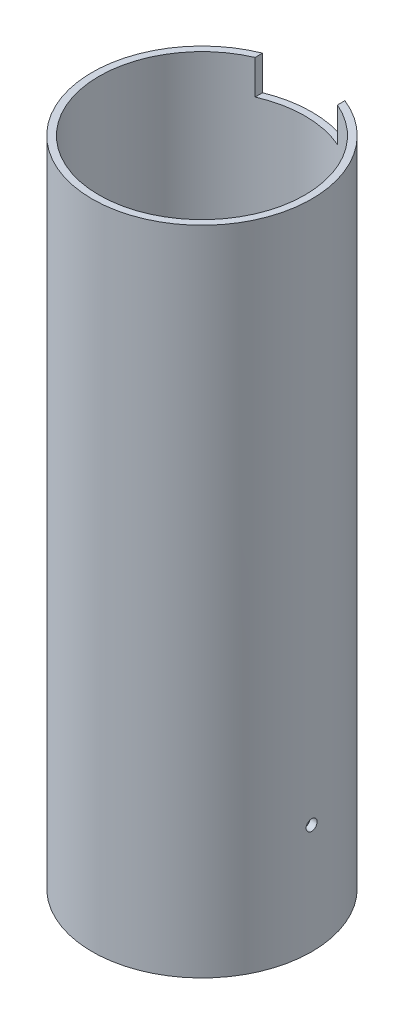
ISO-10303-21;
HEADER;
FILE_DESCRIPTION(('STEP AP214'),'2;1');
FILE_NAME('part.step','',(''),(''),'','','');
FILE_SCHEMA(('AUTOMOTIVE_DESIGN { 1 0 10303 214 1 1 1 1 }'));
ENDSEC;
DATA;
#1=APPLICATION_CONTEXT('core data for automotive mechanical design processes');
#2=APPLICATION_PROTOCOL_DEFINITION('international standard','automotive_design',2000,#1);
#3=PRODUCT_CONTEXT('',#1,'mechanical');
#4=PRODUCT('Part','Part','',(#3));
#5=PRODUCT_RELATED_PRODUCT_CATEGORY('part','',(#4));
#6=PRODUCT_DEFINITION_FORMATION('','',#4);
#7=PRODUCT_DEFINITION_CONTEXT('part definition',#1,'design');
#8=PRODUCT_DEFINITION('design','',#6,#7);
#9=PRODUCT_DEFINITION_SHAPE('','',#8);
#10=(LENGTH_UNIT() NAMED_UNIT(*) SI_UNIT(.MILLI.,.METRE.));
#11=(NAMED_UNIT(*) PLANE_ANGLE_UNIT() SI_UNIT($,.RADIAN.));
#12=(NAMED_UNIT(*) SI_UNIT($,.STERADIAN.) SOLID_ANGLE_UNIT());
#13=UNCERTAINTY_MEASURE_WITH_UNIT(LENGTH_MEASURE(1.E-05),#10,'distance_accuracy_value','');
#14=(GEOMETRIC_REPRESENTATION_CONTEXT(3) GLOBAL_UNCERTAINTY_ASSIGNED_CONTEXT((#13)) GLOBAL_UNIT_ASSIGNED_CONTEXT((#10,
#11,#12)) REPRESENTATION_CONTEXT('',''));
#15=CARTESIAN_POINT('',(0.,0.,0.));
#16=DIRECTION('',(0.,0.,1.));
#17=DIRECTION('',(1.,0.,0.));
#18=AXIS2_PLACEMENT_3D('',#15,#16,#17);
#19=CARTESIAN_POINT('',(0.,301.625,0.));
#20=DIRECTION('',(0.,1.,0.));
#21=DIRECTION('',(0.,0.,1.));
#22=AXIS2_PLACEMENT_3D('',#19,#20,#21);
#23=PLANE('',#22);
#24=DIRECTION('',(0.,0.,-1.));
#25=VECTOR('',#24,1.);
#26=CARTESIAN_POINT('',(19.0500000000001,301.625,0.));
#27=LINE('',#26,#25);
#28=CARTESIAN_POINT('',(19.0500000000001,301.625,-43.6490334944543));
#29=VERTEX_POINT('',#28);
#30=CARTESIAN_POINT('',(19.0500000000001,301.625,-47.0928603930574));
#31=VERTEX_POINT('',#30);
#32=EDGE_CURVE('E118',#29,#31,#27,.T.);
#33=ORIENTED_EDGE('',*,*,#32,.F.);
#34=CARTESIAN_POINT('',(0.,301.625,0.));
#35=DIRECTION('',(0.,1.,0.));
#36=DIRECTION('',(0.,0.,1.));
#37=AXIS2_PLACEMENT_3D('',#34,#35,#36);
#38=CIRCLE('',#37,47.625);
#39=CARTESIAN_POINT('',(-19.0499999999999,301.625,-43.6490334944544));
#40=VERTEX_POINT('',#39);
#41=EDGE_CURVE('E121',#40,#29,#38,.T.);
#42=ORIENTED_EDGE('',*,*,#41,.F.);
#43=DIRECTION('',(0.,0.,1.));
#44=VECTOR('',#43,1.);
#45=CARTESIAN_POINT('',(-19.0499999999999,301.625,0.));
#46=LINE('',#45,#44);
#47=CARTESIAN_POINT('',(-19.0499999999999,301.625,-47.0928603930575));
#48=VERTEX_POINT('',#47);
#49=EDGE_CURVE('E60',#48,#40,#46,.T.);
#50=ORIENTED_EDGE('',*,*,#49,.F.);
#51=CARTESIAN_POINT('',(0.,301.625,0.));
#52=DIRECTION('',(0.,1.,0.));
#53=DIRECTION('',(1.,0.,0.));
#54=AXIS2_PLACEMENT_3D('',#51,#52,#53);
#55=CIRCLE('',#54,50.8);
#56=EDGE_CURVE('E105',#48,#31,#55,.T.);
#57=ORIENTED_EDGE('',*,*,#56,.T.);
#58=EDGE_LOOP('',(#33,#42,#50,#57));
#59=FACE_BOUND('',#58,.T.);
#60=ADVANCED_FACE('F39',(#59),#23,.T.);
#61=CARTESIAN_POINT('',(0.,0.,0.));
#62=DIRECTION('',(0.,1.,0.));
#63=DIRECTION('',(0.,0.,1.));
#64=AXIS2_PLACEMENT_3D('',#61,#62,#63);
#65=PLANE('',#64);
#66=CARTESIAN_POINT('',(0.,0.,0.));
#67=DIRECTION('',(0.,1.,0.));
#68=DIRECTION('',(1.,0.,0.));
#69=AXIS2_PLACEMENT_3D('',#66,#67,#68);
#70=CIRCLE('',#69,50.8);
#71=CARTESIAN_POINT('',(50.8,0.,0.));
#72=VERTEX_POINT('',#71);
#73=EDGE_CURVE('E124',#72,#72,#70,.T.);
#74=ORIENTED_EDGE('',*,*,#73,.F.);
#75=EDGE_LOOP('',(#74));
#76=FACE_BOUND('',#75,.T.);
#77=CARTESIAN_POINT('',(0.,0.,0.));
#78=DIRECTION('',(0.,1.,0.));
#79=DIRECTION('',(0.,0.,1.));
#80=AXIS2_PLACEMENT_3D('',#77,#78,#79);
#81=CIRCLE('',#80,47.625);
#82=CARTESIAN_POINT('',(0.,0.,47.625));
#83=VERTEX_POINT('',#82);
#84=EDGE_CURVE('E120',#83,#83,#81,.T.);
#85=ORIENTED_EDGE('',*,*,#84,.T.);
#86=EDGE_LOOP('',(#85));
#87=FACE_BOUND('',#86,.T.);
#88=ADVANCED_FACE('F165',(#76,#87),#65,.F.);
#89=CARTESIAN_POINT('',(0.,301.625,0.));
#90=DIRECTION('',(0.,-1.,0.));
#91=DIRECTION('',(0.,0.,-1.));
#92=AXIS2_PLACEMENT_3D('',#89,#90,#91);
#93=CYLINDRICAL_SURFACE('',#92,50.8);
#94=CARTESIAN_POINT('',(-50.736460262813,203.2,-2.54));
#95=CARTESIAN_POINT('',(-50.7364611163528,203.057422792148,-2.5399937075263));
#96=CARTESIAN_POINT('',(-50.7370677181229,202.914744472424,-2.52795480145709));
#97=CARTESIAN_POINT('',(-50.7394290073318,202.633323835113,-2.48009995771671));
#98=CARTESIAN_POINT('',(-50.7411850474678,202.494586356206,-2.44425600475199));
#99=CARTESIAN_POINT('',(-50.7456458037569,202.225164785184,-2.34981990072743));
#100=CARTESIAN_POINT('',(-50.7483500362319,202.094476626951,-2.29123934610892));
#101=CARTESIAN_POINT('',(-50.7544018540624,201.844824023574,-2.15301072684606));
#102=CARTESIAN_POINT('',(-50.7577492875055,201.725856820172,-2.07336763512081));
#103=CARTESIAN_POINT('',(-50.7647141901265,201.502867314049,-1.89518492180225));
#104=CARTESIAN_POINT('',(-50.7683318958927,201.398858343855,-1.79662862293201));
#105=CARTESIAN_POINT('',(-50.775427466358,201.20885139811,-1.58345045881675));
#106=CARTESIAN_POINT('',(-50.7789053253442,201.122854157742,-1.4688279381158));
#107=CARTESIAN_POINT('',(-50.7853311021939,200.971275299313,-1.22670148525887));
#108=CARTESIAN_POINT('',(-50.7882787509777,200.905704035067,-1.09919106352648));
#109=CARTESIAN_POINT('',(-50.7933095544687,200.796904917453,-0.834954056949689));
#110=CARTESIAN_POINT('',(-50.7953927157182,200.753676894993,-0.698227541860795));
#111=CARTESIAN_POINT('',(-50.7984582144596,200.690826479413,-0.419561887466529));
#112=CARTESIAN_POINT('',(-50.7994414800001,200.671184184557,-0.277627247180353));
#113=CARTESIAN_POINT('',(-50.8001994952912,200.656001378866,0.0075278357309239));
#114=CARTESIAN_POINT('',(-50.7999742545521,200.660460678364,0.150748268228673));
#115=CARTESIAN_POINT('',(-50.7983414212757,200.693337960621,0.434274671436469));
#116=CARTESIAN_POINT('',(-50.7969348859111,200.721734521358,0.574583133141414));
#117=CARTESIAN_POINT('',(-50.7930991102904,200.801647045051,0.848439232514648));
#118=CARTESIAN_POINT('',(-50.7906698657465,200.853163104938,0.981986841834871));
#119=CARTESIAN_POINT('',(-50.7850604899265,200.97787669915,1.23859928178379));
#120=CARTESIAN_POINT('',(-50.7818800207565,201.051083993777,1.36165936122292));
#121=CARTESIAN_POINT('',(-50.775126365566,201.217094841025,1.59375158462423));
#122=CARTESIAN_POINT('',(-50.7715531767722,201.309898532032,1.70278362951407));
#123=CARTESIAN_POINT('',(-50.7644118606083,201.512588920069,1.90384970277628));
#124=CARTESIAN_POINT('',(-50.7608437430579,201.622494202881,1.99586499661019));
#125=CARTESIAN_POINT('',(-50.7541187598298,201.8562026731,2.16014126632985));
#126=CARTESIAN_POINT('',(-50.7509618942614,201.980005864201,2.23240223696669));
#127=CARTESIAN_POINT('',(-50.7454157123355,202.238007137749,2.35511699899829));
#128=CARTESIAN_POINT('',(-50.7430264207732,202.372205555824,2.40557008594243));
#129=CARTESIAN_POINT('',(-50.7392857750674,202.647182773828,2.48322438874189));
#130=CARTESIAN_POINT('',(-50.7379344131174,202.787961524257,2.51042577947529));
#131=CARTESIAN_POINT('',(-50.7364234627177,203.071940014819,2.54078137091998));
#132=CARTESIAN_POINT('',(-50.7362625855858,203.215136968872,2.54396157428779));
#133=CARTESIAN_POINT('',(-50.7371473825154,203.500030481419,2.5262523736909));
#134=CARTESIAN_POINT('',(-50.7381930525868,203.641727044871,2.50536304932369));
#135=CARTESIAN_POINT('',(-50.7413719106485,203.919524487196,2.44012933104219));
#136=CARTESIAN_POINT('',(-50.7435045467824,204.055628167738,2.39579683887428));
#137=CARTESIAN_POINT('',(-50.748616500291,204.318462662945,2.28494726780525));
#138=CARTESIAN_POINT('',(-50.7515958225653,204.445193423365,2.21843006052322));
#139=CARTESIAN_POINT('',(-50.7580684879104,204.685804283451,2.06503250385426));
#140=CARTESIAN_POINT('',(-50.7615622709231,204.799673235573,1.97813468787858));
#141=CARTESIAN_POINT('',(-50.7686685253573,205.01121602237,1.78646814244094));
#142=CARTESIAN_POINT('',(-50.7722809975375,205.108889753498,1.68169929872544));
#143=CARTESIAN_POINT('',(-50.779221237017,205.285356876723,1.45715301900171));
#144=CARTESIAN_POINT('',(-50.7825487493609,205.3641334726,1.33736237418506));
#145=CARTESIAN_POINT('',(-50.7885404103759,205.500455320121,1.0862396789402));
#146=CARTESIAN_POINT('',(-50.7912045619343,205.558000664172,0.954907678747129));
#147=CARTESIAN_POINT('',(-50.7955680323706,205.650197138892,0.684492788261208));
#148=CARTESIAN_POINT('',(-50.7972678040329,205.68485901479,0.545413569091171));
#149=CARTESIAN_POINT('',(-50.7995127519606,205.730339818933,0.26340078428858));
#150=CARTESIAN_POINT('',(-50.8000579347404,205.741158881704,0.120467240407393));
#151=CARTESIAN_POINT('',(-50.7999322924838,205.738645659182,-0.165030120097908));
#152=CARTESIAN_POINT('',(-50.7992627939984,205.725339720766,-0.307594169988845));
#153=CARTESIAN_POINT('',(-50.7967857708073,205.675008665243,-0.588461642187836));
#154=CARTESIAN_POINT('',(-50.794978243958,205.637983503459,-0.726765056469927));
#155=CARTESIAN_POINT('',(-50.7904285222172,205.541270397417,-0.995190852071847));
#156=CARTESIAN_POINT('',(-50.7876863204596,205.481582286675,-1.12531317328424));
#157=CARTESIAN_POINT('',(-50.7815756457273,205.341242189432,-1.37369135923979));
#158=CARTESIAN_POINT('',(-50.7782071919783,205.260590846463,-1.49194758809523));
#159=CARTESIAN_POINT('',(-50.7712189511866,205.080519399298,-1.7133683171344));
#160=CARTESIAN_POINT('',(-50.7675989205081,204.981080936269,-1.81651787852328));
#161=CARTESIAN_POINT('',(-50.7605171727002,204.766269870055,-2.00469169163277));
#162=CARTESIAN_POINT('',(-50.7570554947411,204.650893352471,-2.08971147757823));
#163=CARTESIAN_POINT('',(-50.7506785608067,204.407390508646,-2.23925224940315));
#164=CARTESIAN_POINT('',(-50.7477638324863,204.279252051195,-2.30375348183291));
#165=CARTESIAN_POINT('',(-50.7428178813464,204.014045756733,-2.41024943407635));
#166=CARTESIAN_POINT('',(-50.7407856154837,203.876988682888,-2.45227073817261));
#167=CARTESIAN_POINT('',(-50.738371857092,203.649233388741,-2.50159168224106));
#168=CARTESIAN_POINT('',(-50.7376581707109,203.560010387101,-2.51597641269591));
#169=CARTESIAN_POINT('',(-50.7367021035138,203.380538439271,-2.53518255988725));
#170=CARTESIAN_POINT('',(-50.7364597222941,203.29028949396,-2.5400039848183));
#171=CARTESIAN_POINT('',(-50.736460262813,203.2,-2.54));
#172=B_SPLINE_CURVE_WITH_KNOTS('',3,(#94,#95,#96,#97,#98,#99,#100,#101,#102,#103,#104,#105,#106,
#107,#108,#109,#110,#111,#112,#113,#114,#115,#116,#117,#118,#119,#120,#121,#122,#123,#124,#125,
#126,#127,#128,#129,#130,#131,#132,#133,#134,#135,#136,#137,#138,#139,#140,#141,#142,#143,#144,
#145,#146,#147,#148,#149,#150,#151,#152,#153,#154,#155,#156,#157,#158,#159,#160,#161,#162,#163,
#164,#165,#166,#167,#168,#169,#170,#171),.UNSPECIFIED.,.T.,.F.,(4,2,2,2,2,2,2,2,2,2,2,2,2,2,2,2,
2,2,2,2,2,2,2,2,2,2,2,2,2,2,2,2,2,2,2,2,2,2,4),(0.,0.427402032080849,0.855307951502546,
1.28299591052079,1.71058298132448,2.13854883661607,2.56653215677592,2.99473206766637,
3.42292873792742,3.85076383956923,4.27859557438281,4.70604483841031,5.13349589457229,
5.56113958170474,5.98878628888502,6.41690104537812,6.84501591562543,7.27314461404899,
7.70127009245026,8.12893206348227,8.55659262024804,8.9840362682845,9.41148238994069,
9.83929618877991,10.2671127228324,10.6953081129658,11.1235016394196,11.5514939587871,
11.9794838633424,12.4070066422845,12.8345302265226,13.262056951459,13.6895705536796,
14.1175041048214,14.5455429442569,14.9739926232384,15.4019345004279,15.6725944947023,
15.9432542570549),.UNSPECIFIED.);
#173=CARTESIAN_POINT('',(-50.736460262813,203.2,-2.54));
#174=VERTEX_POINT('',#173);
#175=EDGE_CURVE('E187',#174,#174,#172,.T.);
#176=ORIENTED_EDGE('',*,*,#175,.F.);
#177=EDGE_LOOP('',(#176));
#178=FACE_BOUND('',#177,.T.);
#179=CARTESIAN_POINT('',(-50.736460262813,50.8,-2.54));
#180=CARTESIAN_POINT('',(-50.7364611163528,50.6574227921484,-2.5399937075263));
#181=CARTESIAN_POINT('',(-50.7370677181229,50.5147444724235,-2.52795480145709));
#182=CARTESIAN_POINT('',(-50.7394290073318,50.2333238351128,-2.48009995771671));
#183=CARTESIAN_POINT('',(-50.7411850474678,50.0945863562057,-2.44425600475199));
#184=CARTESIAN_POINT('',(-50.7456458037569,49.8251647851843,-2.34981990072744));
#185=CARTESIAN_POINT('',(-50.7483500362319,49.6944766269507,-2.29123934610892));
#186=CARTESIAN_POINT('',(-50.7544018540624,49.4448240235739,-2.15301072684607));
#187=CARTESIAN_POINT('',(-50.7577492875055,49.3258568201716,-2.07336763512081));
#188=CARTESIAN_POINT('',(-50.7647141901265,49.1028673140486,-1.89518492180225));
#189=CARTESIAN_POINT('',(-50.7683318958927,48.9988583438549,-1.79662862293201));
#190=CARTESIAN_POINT('',(-50.775427466358,48.8088513981097,-1.58345045881675));
#191=CARTESIAN_POINT('',(-50.7789053253442,48.7228541577424,-1.46882793811581));
#192=CARTESIAN_POINT('',(-50.7853311021939,48.5712752993128,-1.2267014852589));
#193=CARTESIAN_POINT('',(-50.7882787509777,48.5057040350671,-1.09919106352651));
#194=CARTESIAN_POINT('',(-50.7933095544687,48.3969049174532,-0.83495405694972));
#195=CARTESIAN_POINT('',(-50.7953927157182,48.3536768949932,-0.698227541860822));
#196=CARTESIAN_POINT('',(-50.7984582144596,48.2908264794132,-0.419561887466553));
#197=CARTESIAN_POINT('',(-50.7994414800001,48.2711841845575,-0.277627247180377));
#198=CARTESIAN_POINT('',(-50.8001994952912,48.256001378866,0.00752783573089983));
#199=CARTESIAN_POINT('',(-50.7999742545521,48.2604606783637,0.15074826822865));
#200=CARTESIAN_POINT('',(-50.7983414212757,48.2933379606208,0.434274671436453));
#201=CARTESIAN_POINT('',(-50.7969348859111,48.3217345213576,0.574583133141406));
#202=CARTESIAN_POINT('',(-50.7930991102904,48.4016470450509,0.84843923251464));
#203=CARTESIAN_POINT('',(-50.7906698657465,48.4531631049377,0.981986841834856));
#204=CARTESIAN_POINT('',(-50.7850604899265,48.57787669915,1.23859928178377));
#205=CARTESIAN_POINT('',(-50.7818800207565,48.6510839937774,1.36165936122291));
#206=CARTESIAN_POINT('',(-50.775126365566,48.8170948410254,1.59375158462422));
#207=CARTESIAN_POINT('',(-50.7715531767722,48.9098985320325,1.70278362951406));
#208=CARTESIAN_POINT('',(-50.7644118606083,49.1125889200687,1.90384970277627));
#209=CARTESIAN_POINT('',(-50.7608437430579,49.2224942028806,1.99586499661018));
#210=CARTESIAN_POINT('',(-50.7541187598298,49.4562026731003,2.16014126632984));
#211=CARTESIAN_POINT('',(-50.7509618942614,49.5800058642009,2.23240223696668));
#212=CARTESIAN_POINT('',(-50.7454157123355,49.8380071377491,2.35511699899829));
#213=CARTESIAN_POINT('',(-50.7430264207732,49.9722055558241,2.40557008594243));
#214=CARTESIAN_POINT('',(-50.7392857750674,50.2471827738278,2.48322438874189));
#215=CARTESIAN_POINT('',(-50.7379344131174,50.3879615242569,2.51042577947529));
#216=CARTESIAN_POINT('',(-50.7364234627177,50.6719400148185,2.54078137091998));
#217=CARTESIAN_POINT('',(-50.7362625855858,50.8151369688725,2.54396157428779));
#218=CARTESIAN_POINT('',(-50.7371473825154,51.1000304814186,2.5262523736909));
#219=CARTESIAN_POINT('',(-50.7381930525868,51.241727044871,2.50536304932369));
#220=CARTESIAN_POINT('',(-50.7413719106485,51.5195244871955,2.4401293310422));
#221=CARTESIAN_POINT('',(-50.7435045467824,51.6556281677381,2.39579683887429));
#222=CARTESIAN_POINT('',(-50.748616500291,51.9184626629453,2.28494726780526));
#223=CARTESIAN_POINT('',(-50.7515958225653,52.0451934233646,2.21843006052324));
#224=CARTESIAN_POINT('',(-50.7580684879104,52.2858042834515,2.06503250385429));
#225=CARTESIAN_POINT('',(-50.7615622709231,52.399673235573,1.9781346878786));
#226=CARTESIAN_POINT('',(-50.7686685253573,52.6112160223703,1.78646814244096));
#227=CARTESIAN_POINT('',(-50.7722809975375,52.7088897534984,1.68169929872546));
#228=CARTESIAN_POINT('',(-50.779221237017,52.8853568767231,1.45715301900173));
#229=CARTESIAN_POINT('',(-50.7825487493609,52.9641334725997,1.33736237418508));
#230=CARTESIAN_POINT('',(-50.7885404103759,53.1004553201211,1.08623967894023));
#231=CARTESIAN_POINT('',(-50.7912045619343,53.1580006641719,0.954907678747157));
#232=CARTESIAN_POINT('',(-50.7955680323706,53.2501971388919,0.684492788261235));
#233=CARTESIAN_POINT('',(-50.7972678040329,53.2848590147895,0.545413569091195));
#234=CARTESIAN_POINT('',(-50.7995127519606,53.3303398189329,0.263400784288601));
#235=CARTESIAN_POINT('',(-50.8000579347404,53.3411588817039,0.120467240407412));
#236=CARTESIAN_POINT('',(-50.7999322924838,53.3386456591819,-0.165030120097891));
#237=CARTESIAN_POINT('',(-50.7992627939984,53.3253397207657,-0.30759416998883));
#238=CARTESIAN_POINT('',(-50.7967857708073,53.2750086652435,-0.58846164218782));
#239=CARTESIAN_POINT('',(-50.794978243958,53.2379835034593,-0.72676505646991));
#240=CARTESIAN_POINT('',(-50.7904285222172,53.1412703974173,-0.995190852071827));
#241=CARTESIAN_POINT('',(-50.7876863204596,53.0815822866748,-1.12531317328421));
#242=CARTESIAN_POINT('',(-50.7815756457273,52.9412421894319,-1.37369135923977));
#243=CARTESIAN_POINT('',(-50.7782071919783,52.8605908464634,-1.49194758809521));
#244=CARTESIAN_POINT('',(-50.7712189511866,52.6805193992985,-1.71336831713439));
#245=CARTESIAN_POINT('',(-50.7675989205081,52.581080936269,-1.81651787852326));
#246=CARTESIAN_POINT('',(-50.7605171727002,52.3662698700545,-2.00469169163275));
#247=CARTESIAN_POINT('',(-50.7570554947411,52.250893352471,-2.08971147757822));
#248=CARTESIAN_POINT('',(-50.7506785608067,52.0073905086461,-2.23925224940314));
#249=CARTESIAN_POINT('',(-50.7477638324863,51.8792520511948,-2.3037534818329));
#250=CARTESIAN_POINT('',(-50.7428178813464,51.6140457567326,-2.41024943407634));
#251=CARTESIAN_POINT('',(-50.7407856154837,51.476988682888,-2.4522707381726));
#252=CARTESIAN_POINT('',(-50.738371857092,51.2492333887406,-2.50159168224105));
#253=CARTESIAN_POINT('',(-50.7376581707109,51.1600103871012,-2.51597641269591));
#254=CARTESIAN_POINT('',(-50.7367021035138,50.9805384392713,-2.53518255988725));
#255=CARTESIAN_POINT('',(-50.7364597222941,50.8902894939599,-2.5400039848183));
#256=CARTESIAN_POINT('',(-50.736460262813,50.8,-2.54));
#257=B_SPLINE_CURVE_WITH_KNOTS('',3,(#179,#180,#181,#182,#183,#184,#185,#186,#187,#188,#189,
#190,#191,#192,#193,#194,#195,#196,#197,#198,#199,#200,#201,#202,#203,#204,#205,#206,#207,#208,
#209,#210,#211,#212,#213,#214,#215,#216,#217,#218,#219,#220,#221,#222,#223,#224,#225,#226,#227,
#228,#229,#230,#231,#232,#233,#234,#235,#236,#237,#238,#239,#240,#241,#242,#243,#244,#245,#246,
#247,#248,#249,#250,#251,#252,#253,#254,#255,#256),.UNSPECIFIED.,.T.,.F.,(4,2,2,2,2,2,2,2,2,2,2,
2,2,2,2,2,2,2,2,2,2,2,2,2,2,2,2,2,2,2,2,2,2,2,2,2,2,2,4),(0.,0.427402032080828,
0.855307951502531,1.28299591052079,1.71058298132448,2.13854883661606,2.56653215677589,
2.99473206766633,3.42292873792739,3.8507638395692,4.27859557438278,4.70604483841029,
5.13349589457227,5.56113958170473,5.98878628888498,6.41690104537811,6.84501591562541,
7.27314461404901,7.70127009245024,8.12893206348227,8.55659262024801,8.98403626828444,
9.41148238994064,9.83929618877986,10.2671127228323,10.6953081129657,11.1235016394196,
11.551493958787,11.9794838633423,12.4070066422845,12.8345302265225,13.262056951459,
13.6895705536796,14.1175041048214,14.5455429442568,14.9739926232384,15.4019345004279,
15.6725944947023,15.9432542570548),.UNSPECIFIED.);
#258=CARTESIAN_POINT('',(-50.736460262813,50.8,-2.54));
#259=VERTEX_POINT('',#258);
#260=EDGE_CURVE('E109',#259,#259,#257,.T.);
#261=ORIENTED_EDGE('',*,*,#260,.F.);
#262=EDGE_LOOP('',(#261));
#263=FACE_BOUND('',#262,.T.);
#264=CARTESIAN_POINT('',(50.736460262813,50.8,2.54));
#265=CARTESIAN_POINT('',(50.7364611163528,50.9425772078516,2.5399937075263));
#266=CARTESIAN_POINT('',(50.7370677181229,51.0852555275765,2.52795480145709));
#267=CARTESIAN_POINT('',(50.7394290073318,51.3666761648872,2.48009995771671));
#268=CARTESIAN_POINT('',(50.7411850474678,51.5054136437943,2.44425600475199));
#269=CARTESIAN_POINT('',(50.7456458037569,51.7748352148156,2.34981990072744));
#270=CARTESIAN_POINT('',(50.7483500362319,51.9055233730493,2.29123934610893));
#271=CARTESIAN_POINT('',(50.7544018540624,52.1551759764261,2.15301072684607));
#272=CARTESIAN_POINT('',(50.7577492875055,52.2741431798284,2.07336763512082));
#273=CARTESIAN_POINT('',(50.7647141901265,52.4971326859514,1.89518492180225));
#274=CARTESIAN_POINT('',(50.7683318958927,52.6011416561451,1.79662862293201));
#275=CARTESIAN_POINT('',(50.775427466358,52.7911486018903,1.58345045881675));
#276=CARTESIAN_POINT('',(50.7789053253442,52.8771458422576,1.46882793811581));
#277=CARTESIAN_POINT('',(50.7853311021939,53.0287247006872,1.2267014852589));
#278=CARTESIAN_POINT('',(50.7882787509777,53.0942959649329,1.09919106352651));
#279=CARTESIAN_POINT('',(50.7933095544687,53.2030950825468,0.83495405694972));
#280=CARTESIAN_POINT('',(50.7953927157182,53.2463231050068,0.698227541860822));
#281=CARTESIAN_POINT('',(50.7984582144596,53.3091735205868,0.419561887466553));
#282=CARTESIAN_POINT('',(50.7994414800001,53.3288158154425,0.277627247180377));
#283=CARTESIAN_POINT('',(50.8001994952912,53.343998621134,-0.00752783573089983));
#284=CARTESIAN_POINT('',(50.7999742545521,53.3395393216363,-0.15074826822865));
#285=CARTESIAN_POINT('',(50.7983414212757,53.3066620393792,-0.434274671436453));
#286=CARTESIAN_POINT('',(50.7969348859111,53.2782654786424,-0.574583133141406));
#287=CARTESIAN_POINT('',(50.7930991102904,53.1983529549491,-0.84843923251464));
#288=CARTESIAN_POINT('',(50.7906698657465,53.1468368950623,-0.981986841834856));
#289=CARTESIAN_POINT('',(50.7850604899265,53.02212330085,-1.23859928178377));
#290=CARTESIAN_POINT('',(50.7818800207565,52.9489160062226,-1.36165936122291));
#291=CARTESIAN_POINT('',(50.775126365566,52.7829051589746,-1.59375158462422));
#292=CARTESIAN_POINT('',(50.7715531767722,52.6901014679675,-1.70278362951406));
#293=CARTESIAN_POINT('',(50.7644118606083,52.4874110799313,-1.90384970277627));
#294=CARTESIAN_POINT('',(50.7608437430579,52.3775057971194,-1.99586499661018));
#295=CARTESIAN_POINT('',(50.7541187598298,52.1437973268997,-2.16014126632984));
#296=CARTESIAN_POINT('',(50.7509618942614,52.0199941357991,-2.23240223696668));
#297=CARTESIAN_POINT('',(50.7454157123355,51.7619928622509,-2.35511699899829));
#298=CARTESIAN_POINT('',(50.7430264207732,51.6277944441759,-2.40557008594243));
#299=CARTESIAN_POINT('',(50.7392857750674,51.3528172261722,-2.48322438874189));
#300=CARTESIAN_POINT('',(50.7379344131174,51.2120384757431,-2.51042577947529));
#301=CARTESIAN_POINT('',(50.7364234627177,50.9280599851815,-2.54078137091998));
#302=CARTESIAN_POINT('',(50.7362625855858,50.7848630311275,-2.54396157428779));
#303=CARTESIAN_POINT('',(50.7371473825154,50.4999695185814,-2.5262523736909));
#304=CARTESIAN_POINT('',(50.7381930525868,50.358272955129,-2.50536304932369));
#305=CARTESIAN_POINT('',(50.7413719106485,50.0804755128045,-2.4401293310422));
#306=CARTESIAN_POINT('',(50.7435045467824,49.9443718322619,-2.39579683887429));
#307=CARTESIAN_POINT('',(50.748616500291,49.6815373370547,-2.28494726780526));
#308=CARTESIAN_POINT('',(50.7515958225653,49.5548065766354,-2.21843006052324));
#309=CARTESIAN_POINT('',(50.7580684879104,49.3141957165485,-2.06503250385429));
#310=CARTESIAN_POINT('',(50.7615622709231,49.200326764427,-1.9781346878786));
#311=CARTESIAN_POINT('',(50.7686685253573,48.9887839776297,-1.78646814244096));
#312=CARTESIAN_POINT('',(50.7722809975375,48.8911102465016,-1.68169929872546));
#313=CARTESIAN_POINT('',(50.779221237017,48.7146431232769,-1.45715301900173));
#314=CARTESIAN_POINT('',(50.7825487493609,48.6358665274003,-1.33736237418508));
#315=CARTESIAN_POINT('',(50.7885404103759,48.4995446798788,-1.08623967894023));
#316=CARTESIAN_POINT('',(50.7912045619343,48.4419993358281,-0.954907678747158));
#317=CARTESIAN_POINT('',(50.7955680323706,48.3498028611081,-0.684492788261235));
#318=CARTESIAN_POINT('',(50.7972678040329,48.3151409852105,-0.545413569091195));
#319=CARTESIAN_POINT('',(50.7995127519606,48.2696601810671,-0.263400784288601));
#320=CARTESIAN_POINT('',(50.8000579347404,48.2588411182961,-0.120467240407413));
#321=CARTESIAN_POINT('',(50.7999322924838,48.2613543408181,0.165030120097891));
#322=CARTESIAN_POINT('',(50.7992627939984,48.2746602792343,0.307594169988829));
#323=CARTESIAN_POINT('',(50.7967857708073,48.3249913347565,0.588461642187819));
#324=CARTESIAN_POINT('',(50.794978243958,48.3620164965407,0.72676505646991));
#325=CARTESIAN_POINT('',(50.7904285222172,48.4587296025827,0.995190852071827));
#326=CARTESIAN_POINT('',(50.7876863204596,48.5184177133252,1.12531317328421));
#327=CARTESIAN_POINT('',(50.7815756457273,48.658757810568,1.37369135923977));
#328=CARTESIAN_POINT('',(50.7782071919783,48.7394091535366,1.49194758809521));
#329=CARTESIAN_POINT('',(50.7712189511866,48.9194806007015,1.71336831713439));
#330=CARTESIAN_POINT('',(50.7675989205081,49.018919063731,1.81651787852326));
#331=CARTESIAN_POINT('',(50.7605171727002,49.2337301299455,2.00469169163275));
#332=CARTESIAN_POINT('',(50.7570554947411,49.349106647529,2.08971147757822));
#333=CARTESIAN_POINT('',(50.7506785608067,49.5926094913539,2.23925224940314));
#334=CARTESIAN_POINT('',(50.7477638324863,49.7207479488052,2.3037534818329));
#335=CARTESIAN_POINT('',(50.7428178813464,49.9859542432674,2.41024943407634));
#336=CARTESIAN_POINT('',(50.7407856154837,50.123011317112,2.4522707381726));
#337=CARTESIAN_POINT('',(50.738371857092,50.3507666112594,2.50159168224105));
#338=CARTESIAN_POINT('',(50.7376581707109,50.4399896128988,2.51597641269591));
#339=CARTESIAN_POINT('',(50.7367021035138,50.6194615607287,2.53518255988725));
#340=CARTESIAN_POINT('',(50.7364597222941,50.7097105060401,2.5400039848183));
#341=CARTESIAN_POINT('',(50.736460262813,50.8,2.54));
#342=B_SPLINE_CURVE_WITH_KNOTS('',3,(#264,#265,#266,#267,#268,#269,#270,#271,#272,#273,#274,
#275,#276,#277,#278,#279,#280,#281,#282,#283,#284,#285,#286,#287,#288,#289,#290,#291,#292,#293,
#294,#295,#296,#297,#298,#299,#300,#301,#302,#303,#304,#305,#306,#307,#308,#309,#310,#311,#312,
#313,#314,#315,#316,#317,#318,#319,#320,#321,#322,#323,#324,#325,#326,#327,#328,#329,#330,#331,
#332,#333,#334,#335,#336,#337,#338,#339,#340,#341),.UNSPECIFIED.,.T.,.F.,(4,2,2,2,2,2,2,2,2,2,2,
2,2,2,2,2,2,2,2,2,2,2,2,2,2,2,2,2,2,2,2,2,2,2,2,2,2,2,4),(0.,0.427402032080828,
0.855307951502531,1.28299591052077,1.71058298132448,2.13854883661606,2.56653215677589,
2.99473206766633,3.42292873792739,3.8507638395692,4.27859557438278,4.70604483841029,
5.13349589457227,5.56113958170473,5.98878628888498,6.41690104537811,6.84501591562541,
7.27314461404901,7.70127009245024,8.12893206348227,8.55659262024801,8.98403626828444,
9.41148238994064,9.83929618877986,10.2671127228323,10.6953081129657,11.1235016394196,
11.551493958787,11.9794838633423,12.4070066422845,12.8345302265225,13.262056951459,
13.6895705536796,14.1175041048214,14.5455429442568,14.9739926232384,15.4019345004279,
15.6725944947023,15.9432542570548),.UNSPECIFIED.);
#343=CARTESIAN_POINT('',(50.736460262813,50.8,2.54));
#344=VERTEX_POINT('',#343);
#345=EDGE_CURVE('E193',#344,#344,#342,.T.);
#346=ORIENTED_EDGE('',*,*,#345,.T.);
#347=EDGE_LOOP('',(#346));
#348=FACE_BOUND('',#347,.T.);
#349=CARTESIAN_POINT('',(0.,285.75,0.));
#350=DIRECTION('',(0.,-1.,0.));
#351=DIRECTION('',(0.,0.,-1.));
#352=AXIS2_PLACEMENT_3D('',#349,#350,#351);
#353=CIRCLE('',#352,50.8);
#354=CARTESIAN_POINT('',(19.0500000000001,285.75,-47.0928603930574));
#355=VERTEX_POINT('',#354);
#356=CARTESIAN_POINT('',(-19.0499999999999,285.75,-47.0928603930575));
#357=VERTEX_POINT('',#356);
#358=EDGE_CURVE('E86',#355,#357,#353,.F.);
#359=ORIENTED_EDGE('',*,*,#358,.F.);
#360=DIRECTION('',(0.,-1.,0.));
#361=VECTOR('',#360,1.);
#362=CARTESIAN_POINT('',(19.0500000000001,301.625,-47.0928603930574));
#363=LINE('',#362,#361);
#364=EDGE_CURVE('E95',#31,#355,#363,.T.);
#365=ORIENTED_EDGE('',*,*,#364,.F.);
#366=ORIENTED_EDGE('',*,*,#56,.F.);
#367=DIRECTION('',(0.,-1.,0.));
#368=VECTOR('',#367,1.);
#369=CARTESIAN_POINT('',(-19.0499999999999,301.625,-47.0928603930575));
#370=LINE('',#369,#368);
#371=EDGE_CURVE('E96',#357,#48,#370,.F.);
#372=ORIENTED_EDGE('',*,*,#371,.F.);
#373=EDGE_LOOP('',(#359,#365,#366,#372));
#374=FACE_BOUND('',#373,.T.);
#375=ORIENTED_EDGE('',*,*,#73,.T.);
#376=EDGE_LOOP('',(#375));
#377=FACE_BOUND('',#376,.T.);
#378=ADVANCED_FACE('F41',(#178,#263,#348,#374,#377),#93,.T.);
#379=CARTESIAN_POINT('',(0.,301.625,0.));
#380=DIRECTION('',(0.,-1.,0.));
#381=DIRECTION('',(0.,0.,-1.));
#382=AXIS2_PLACEMENT_3D('',#379,#380,#381);
#383=CYLINDRICAL_SURFACE('',#382,47.625);
#384=CARTESIAN_POINT('',(-47.5572184321161,203.2,-2.54));
#385=CARTESIAN_POINT('',(-47.5572193417347,203.342564016423,-2.53999371258318));
#386=CARTESIAN_POINT('',(-47.557866377308,203.485228822256,-2.52795702495714));
#387=CARTESIAN_POINT('',(-47.5603850243747,203.766621898455,-2.48011150779385));
#388=CARTESIAN_POINT('',(-47.5622580744012,203.905345344504,-2.44427475193579));
#389=CARTESIAN_POINT('',(-47.5670159828222,204.174738777218,-2.34985888808882));
#390=CARTESIAN_POINT('',(-47.5699003208694,204.305412865017,-2.2912914742605));
#391=CARTESIAN_POINT('',(-47.5763551433577,204.555040111552,-2.15309500190786));
#392=CARTESIAN_POINT('',(-47.5799254669713,204.673996007717,-2.07347087842654));
#393=CARTESIAN_POINT('',(-47.5873545648766,204.896979980398,-1.89532129307826));
#394=CARTESIAN_POINT('',(-47.5912136222346,205.000993107921,-1.79677713034829));
#395=CARTESIAN_POINT('',(-47.5987826914406,205.191011398951,-1.58362252352787));
#396=CARTESIAN_POINT('',(-47.6024926971673,205.277015823489,-1.46901142046958));
#397=CARTESIAN_POINT('',(-47.6093478530209,205.428617809534,-1.22689640892181));
#398=CARTESIAN_POINT('',(-47.6124926750893,205.494203535163,-1.099385079227));
#399=CARTESIAN_POINT('',(-47.6178601928164,205.603030474501,-0.835141389565137));
#400=CARTESIAN_POINT('',(-47.6200828961614,205.646271874459,-0.698409106468744));
#401=CARTESIAN_POINT('',(-47.6233537986897,205.709142682065,-0.419744099434568));
#402=CARTESIAN_POINT('',(-47.6244031242364,205.728794735226,-0.277816498077046));
#403=CARTESIAN_POINT('',(-47.6252128080392,205.743998898056,0.00732665697687684));
#404=CARTESIAN_POINT('',(-47.6249731775136,205.739551217477,0.150542199452849));
#405=CARTESIAN_POINT('',(-47.6232328985564,205.706700928603,0.434042523830051));
#406=CARTESIAN_POINT('',(-47.6217335330177,205.678322690676,0.574330138585766));
#407=CARTESIAN_POINT('',(-47.6176441267987,205.598454629091,0.84814761990824));
#408=CARTESIAN_POINT('',(-47.6150540810832,205.546964698735,0.981677455273863));
#409=CARTESIAN_POINT('',(-47.6090728248164,205.42230712205,1.23826737135016));
#410=CARTESIAN_POINT('',(-47.6056812046131,205.349128386581,1.36132205475317));
#411=CARTESIAN_POINT('',(-47.5984786874578,205.183178565309,1.59340961755928));
#412=CARTESIAN_POINT('',(-47.5946677871144,205.090407321023,1.70244238352716));
#413=CARTESIAN_POINT('',(-47.5870502051006,204.887768178302,1.90353323023407));
#414=CARTESIAN_POINT('',(-47.5832435345928,204.777879134228,1.99557000429234));
#415=CARTESIAN_POINT('',(-47.5760683305356,204.544197973679,2.15989210905287));
#416=CARTESIAN_POINT('',(-47.5726997971152,204.420405853111,2.23217743394175));
#417=CARTESIAN_POINT('',(-47.5667811063994,204.162419515247,2.35494294939948));
#418=CARTESIAN_POINT('',(-47.5642309800595,204.028224904723,2.40542231520239));
#419=CARTESIAN_POINT('',(-47.5602378467564,203.753248784486,2.48312864045192));
#420=CARTESIAN_POINT('',(-47.5587948303187,203.612467331152,2.51035579888664));
#421=CARTESIAN_POINT('',(-47.5571804053135,203.328499459154,2.54075843091092));
#422=CARTESIAN_POINT('',(-47.5570074326661,203.185316216327,2.54396348821715));
#423=CARTESIAN_POINT('',(-47.5579485175586,202.900446006928,2.52630816324964));
#424=CARTESIAN_POINT('',(-47.5590625702456,202.758759034716,2.50544787172051));
#425=CARTESIAN_POINT('',(-47.5624507180513,202.480986575656,2.44027854184322));
#426=CARTESIAN_POINT('',(-47.5647241422386,202.34489789823,2.39598306494571));
#427=CARTESIAN_POINT('',(-47.5701742368204,202.082086752637,2.28521447757356));
#428=CARTESIAN_POINT('',(-47.5733509131707,201.955364346237,2.21874122086141));
#429=CARTESIAN_POINT('',(-47.5802532891399,201.714746874431,2.06542815860369));
#430=CARTESIAN_POINT('',(-47.5839795228032,201.600864478702,1.97856849299858));
#431=CARTESIAN_POINT('',(-47.5915591698739,201.389287221826,1.78697722768934));
#432=CARTESIAN_POINT('',(-47.5954125841997,201.291592477625,1.68224549888196));
#433=CARTESIAN_POINT('',(-47.6028168688942,201.115064178782,1.45775592792081));
#434=CARTESIAN_POINT('',(-47.6063674302802,201.036249741801,1.33798304094809));
#435=CARTESIAN_POINT('',(-47.6127614526553,200.899850033288,1.08688701372233));
#436=CARTESIAN_POINT('',(-47.6156049170381,200.842264659864,0.955563928910147));
#437=CARTESIAN_POINT('',(-47.6202628254663,200.749991102719,0.685166199275737));
#438=CARTESIAN_POINT('',(-47.6220778176326,200.715290720899,0.546095726887115));
#439=CARTESIAN_POINT('',(-47.6244764238113,200.669732223585,0.264092604705648));
#440=CARTESIAN_POINT('',(-47.6250600460363,200.658873949079,0.121159980677563));
#441=CARTESIAN_POINT('',(-47.6249301754764,200.661309400677,-0.164320503925005));
#442=CARTESIAN_POINT('',(-47.6242182922726,200.674573156717,-0.306868621880671));
#443=CARTESIAN_POINT('',(-47.6215807080608,200.72481415972,-0.587711049803464));
#444=CARTESIAN_POINT('',(-47.6196550047995,200.761791450705,-0.726005351873231));
#445=CARTESIAN_POINT('',(-47.6148063825219,200.858403560274,-0.994420254461877));
#446=CARTESIAN_POINT('',(-47.6118834591743,200.91803847727,-1.12454081947546));
#447=CARTESIAN_POINT('',(-47.6053689848081,201.058268159528,-1.37292530209293));
#448=CARTESIAN_POINT('',(-47.6017774535333,201.138862305897,-1.49118956965179));
#449=CARTESIAN_POINT('',(-47.5943247833013,201.318831130064,-1.71265483720685));
#450=CARTESIAN_POINT('',(-47.5904633439012,201.41822695343,-1.8158386428728));
#451=CARTESIAN_POINT('',(-47.582908225834,201.632958937733,-2.00408858995593));
#452=CARTESIAN_POINT('',(-47.5792145886208,201.748299009407,-2.08915027341015));
#453=CARTESIAN_POINT('',(-47.5724089381889,201.991746144608,-2.23878690924163));
#454=CARTESIAN_POINT('',(-47.5692975268276,202.119866211662,-2.30334070980175));
#455=CARTESIAN_POINT('',(-47.5640165741377,202.385047560765,-2.40994352420407));
#456=CARTESIAN_POINT('',(-47.5618459231549,202.522098088268,-2.45201906551457));
#457=CARTESIAN_POINT('',(-47.5592648163957,202.749997476001,-2.50145905852131));
#458=CARTESIAN_POINT('',(-47.5585008176214,202.839370896309,-2.51589340150674));
#459=CARTESIAN_POINT('',(-47.5574773371893,203.019149356178,-2.53516586195806));
#460=CARTESIAN_POINT('',(-47.5572178550349,203.109554394724,-2.54000398886924));
#461=CARTESIAN_POINT('',(-47.5572184321161,203.2,-2.54));
#462=B_SPLINE_CURVE_WITH_KNOTS('',3,(#384,#385,#386,#387,#388,#389,#390,#391,#392,#393,#394,
#395,#396,#397,#398,#399,#400,#401,#402,#403,#404,#405,#406,#407,#408,#409,#410,#411,#412,#413,
#414,#415,#416,#417,#418,#419,#420,#421,#422,#423,#424,#425,#426,#427,#428,#429,#430,#431,#432,
#433,#434,#435,#436,#437,#438,#439,#440,#441,#442,#443,#444,#445,#446,#447,#448,#449,#450,#451,
#452,#453,#454,#455,#456,#457,#458,#459,#460,#461),.UNSPECIFIED.,.T.,.F.,(4,2,2,2,2,2,2,2,2,2,2,
2,2,2,2,2,2,2,2,2,2,2,2,2,2,2,2,2,2,2,2,2,2,2,2,2,2,2,4),(0.,0.427361882757796,
0.855226107815544,1.28287050225473,1.71041475873299,2.13838380268667,2.56637040445707,
2.99460463247924,3.4228352909596,3.85065452312895,4.27847003177888,4.70585038766955,
5.13323271662492,5.56083393742887,5.98843861724552,6.41657576887832,6.84471304652302,
7.27286651616988,7.70101632172185,8.1286387651201,8.55625959606302,8.98363324201865,
9.41100970607835,9.83880425319695,10.2666018907257,10.6948308900791,11.1230578340488,
11.5510563407104,11.97905199286,12.4065162513006,12.833981303296,13.2614482119973,
13.6889024997064,14.1168404193255,14.5448834885632,14.9733666185142,15.4013429555201,
15.6724705736448,15.9435979249064),.UNSPECIFIED.);
#463=CARTESIAN_POINT('',(-47.5572184321161,203.2,-2.54));
#464=VERTEX_POINT('',#463);
#465=EDGE_CURVE('E43',#464,#464,#462,.T.);
#466=ORIENTED_EDGE('',*,*,#465,.F.);
#467=EDGE_LOOP('',(#466));
#468=FACE_BOUND('',#467,.T.);
#469=CARTESIAN_POINT('',(-47.5572184321161,50.8,-2.54));
#470=CARTESIAN_POINT('',(-47.5572193417347,50.9425640164226,-2.53999371258318));
#471=CARTESIAN_POINT('',(-47.557866377308,51.0852288222563,-2.52795702495714));
#472=CARTESIAN_POINT('',(-47.5603850243747,51.366621898455,-2.48011150779384));
#473=CARTESIAN_POINT('',(-47.5622580744012,51.5053453445041,-2.44427475193578));
#474=CARTESIAN_POINT('',(-47.5670159828222,51.7747387772177,-2.34985888808882));
#475=CARTESIAN_POINT('',(-47.5699003208694,51.9054128650166,-2.2912914742605));
#476=CARTESIAN_POINT('',(-47.5763551433577,52.155040111552,-2.15309500190786));
#477=CARTESIAN_POINT('',(-47.5799254669713,52.2739960077167,-2.07347087842654));
#478=CARTESIAN_POINT('',(-47.5873545648766,52.4969799803977,-1.89532129307825));
#479=CARTESIAN_POINT('',(-47.5912136222346,52.6009931079213,-1.79677713034827));
#480=CARTESIAN_POINT('',(-47.5987826914406,52.7910113989511,-1.58362252352784));
#481=CARTESIAN_POINT('',(-47.6024926971673,52.8770158234892,-1.46901142046956));
#482=CARTESIAN_POINT('',(-47.6093478530209,53.028617809534,-1.2268964089218));
#483=CARTESIAN_POINT('',(-47.6124926750893,53.094203535163,-1.09938507922699));
#484=CARTESIAN_POINT('',(-47.6178601928164,53.2030304745015,-0.835141389565139));
#485=CARTESIAN_POINT('',(-47.6200828961614,53.2462718744588,-0.69840910646875));
#486=CARTESIAN_POINT('',(-47.6233537986897,53.3091426820653,-0.419744099434579));
#487=CARTESIAN_POINT('',(-47.6244031242364,53.3287947352261,-0.277816498077057));
#488=CARTESIAN_POINT('',(-47.6252128080392,53.3439988980559,0.00732665697686889));
#489=CARTESIAN_POINT('',(-47.6249731775136,53.3395512174772,0.150542199452843));
#490=CARTESIAN_POINT('',(-47.6232328985564,53.3067009286031,0.434042523830047));
#491=CARTESIAN_POINT('',(-47.6217335330177,53.2783226906762,0.574330138585761));
#492=CARTESIAN_POINT('',(-47.6176441267987,53.1984546290907,0.848147619908234));
#493=CARTESIAN_POINT('',(-47.6150540810832,53.1469646987347,0.981677455273858));
#494=CARTESIAN_POINT('',(-47.6090728248164,53.0223071220501,1.23826737135016));
#495=CARTESIAN_POINT('',(-47.6056812046131,52.9491283865807,1.36132205475316));
#496=CARTESIAN_POINT('',(-47.5984786874578,52.7831785653095,1.59340961755928));
#497=CARTESIAN_POINT('',(-47.5946677871144,52.6904073210232,1.70244238352716));
#498=CARTESIAN_POINT('',(-47.5870502051006,52.4877681783016,1.90353323023406));
#499=CARTESIAN_POINT('',(-47.5832435345928,52.377879134228,1.99557000429232));
#500=CARTESIAN_POINT('',(-47.5760683305356,52.1441979736788,2.15989210905285));
#501=CARTESIAN_POINT('',(-47.5726997971152,52.0204058531111,2.23217743394174));
#502=CARTESIAN_POINT('',(-47.5667811063994,51.7624195152468,2.35494294939948));
#503=CARTESIAN_POINT('',(-47.5642309800595,51.6282249047235,2.40542231520238));
#504=CARTESIAN_POINT('',(-47.5602378467564,51.3532487844861,2.48312864045192));
#505=CARTESIAN_POINT('',(-47.5587948303187,51.2124673311518,2.51035579888663));
#506=CARTESIAN_POINT('',(-47.5571804053135,50.9284994591535,2.54075843091092));
#507=CARTESIAN_POINT('',(-47.5570074326661,50.7853162163273,2.54396348821715));
#508=CARTESIAN_POINT('',(-47.5579485175586,50.5004460069285,2.52630816324964));
#509=CARTESIAN_POINT('',(-47.5590625702456,50.358759034716,2.50544787172051));
#510=CARTESIAN_POINT('',(-47.5624507180513,50.0809865756563,2.44027854184322));
#511=CARTESIAN_POINT('',(-47.5647241422386,49.9448978982297,2.39598306494571));
#512=CARTESIAN_POINT('',(-47.5701742368204,49.6820867526369,2.28521447757356));
#513=CARTESIAN_POINT('',(-47.5733509131707,49.5553643462374,2.21874122086141));
#514=CARTESIAN_POINT('',(-47.5802532891399,49.3147468744306,2.06542815860369));
#515=CARTESIAN_POINT('',(-47.5839795228032,49.2008644787017,1.97856849299858));
#516=CARTESIAN_POINT('',(-47.5915591698739,48.9892872218262,1.78697722768933));
#517=CARTESIAN_POINT('',(-47.5954125841997,48.8915924776251,1.68224549888195));
#518=CARTESIAN_POINT('',(-47.6028168688942,48.715064178782,1.4577559279208));
#519=CARTESIAN_POINT('',(-47.6063674302802,48.6362497418006,1.33798304094808));
#520=CARTESIAN_POINT('',(-47.6127614526553,48.4998500332878,1.08688701372232));
#521=CARTESIAN_POINT('',(-47.6156049170382,48.442264659864,0.955563928910146));
#522=CARTESIAN_POINT('',(-47.6202628254663,48.3499911027194,0.685166199275741));
#523=CARTESIAN_POINT('',(-47.6220778176326,48.3152907208987,0.546095726887121));
#524=CARTESIAN_POINT('',(-47.6244764238113,48.2697322235849,0.264092604705655));
#525=CARTESIAN_POINT('',(-47.6250600460363,48.2588739490787,0.12115998067757));
#526=CARTESIAN_POINT('',(-47.6249301754764,48.2613094006769,-0.164320503924997));
#527=CARTESIAN_POINT('',(-47.6242182922726,48.274573156717,-0.306868621880661));
#528=CARTESIAN_POINT('',(-47.6215807080608,48.3248141597201,-0.587711049803456));
#529=CARTESIAN_POINT('',(-47.6196550047995,48.3617914507053,-0.726005351873225));
#530=CARTESIAN_POINT('',(-47.6148063825219,48.4584035602737,-0.994420254461875));
#531=CARTESIAN_POINT('',(-47.6118834591743,48.5180384772698,-1.12454081947545));
#532=CARTESIAN_POINT('',(-47.6053689848081,48.658268159528,-1.37292530209292));
#533=CARTESIAN_POINT('',(-47.6017774535333,48.7388623058971,-1.49118956965179));
#534=CARTESIAN_POINT('',(-47.5943247833013,48.9188311300638,-1.71265483720685));
#535=CARTESIAN_POINT('',(-47.5904633439012,49.0182269534296,-1.81583864287279));
#536=CARTESIAN_POINT('',(-47.582908225834,49.2329589377331,-2.00408858995592));
#537=CARTESIAN_POINT('',(-47.5792145886208,49.3482990094071,-2.08915027341014));
#538=CARTESIAN_POINT('',(-47.5724089381889,49.5917461446077,-2.23878690924163));
#539=CARTESIAN_POINT('',(-47.5692975268276,49.7198662116619,-2.30334070980174));
#540=CARTESIAN_POINT('',(-47.5640165741377,49.9850475607651,-2.40994352420407));
#541=CARTESIAN_POINT('',(-47.5618459231549,50.1220980882676,-2.45201906551457));
#542=CARTESIAN_POINT('',(-47.5592648163957,50.3499974760011,-2.50145905852132));
#543=CARTESIAN_POINT('',(-47.5585008176214,50.439370896309,-2.51589340150674));
#544=CARTESIAN_POINT('',(-47.5574773371893,50.6191493561782,-2.53516586195806));
#545=CARTESIAN_POINT('',(-47.5572178550349,50.7095543947241,-2.54000398886924));
#546=CARTESIAN_POINT('',(-47.5572184321161,50.8,-2.54));
#547=B_SPLINE_CURVE_WITH_KNOTS('',3,(#469,#470,#471,#472,#473,#474,#475,#476,#477,#478,#479,
#480,#481,#482,#483,#484,#485,#486,#487,#488,#489,#490,#491,#492,#493,#494,#495,#496,#497,#498,
#499,#500,#501,#502,#503,#504,#505,#506,#507,#508,#509,#510,#511,#512,#513,#514,#515,#516,#517,
#518,#519,#520,#521,#522,#523,#524,#525,#526,#527,#528,#529,#530,#531,#532,#533,#534,#535,#536,
#537,#538,#539,#540,#541,#542,#543,#544,#545,#546),.UNSPECIFIED.,.T.,.F.,(4,2,2,2,2,2,2,2,2,2,2,
2,2,2,2,2,2,2,2,2,2,2,2,2,2,2,2,2,2,2,2,2,2,2,2,2,2,2,4),(0.,0.427361882757789,
0.855226107815544,1.28287050225475,1.710414758733,2.13838380268673,2.56637040445709,
2.99460463247924,3.42283529095958,3.85065452312895,4.27847003177887,4.70585038766955,
5.13323271662492,5.56083393742888,5.98843861724551,6.41657576887829,6.84471304652299,
7.27286651616985,7.70101632172186,8.12863876512009,8.55625959606299,8.98363324201862,
9.41100970607835,9.83880425319697,10.2666018907257,10.6948308900791,11.1230578340488,
11.5510563407103,11.97905199286,12.4065162513006,12.833981303296,13.2614482119973,
13.6889024997064,14.1168404193254,14.5448834885632,14.9733666185142,15.4013429555201,
15.6724705736448,15.9435979249064),.UNSPECIFIED.);
#548=CARTESIAN_POINT('',(-47.5572184321161,50.8,-2.54));
#549=VERTEX_POINT('',#548);
#550=EDGE_CURVE('E100',#549,#549,#547,.T.);
#551=ORIENTED_EDGE('',*,*,#550,.F.);
#552=EDGE_LOOP('',(#551));
#553=FACE_BOUND('',#552,.T.);
#554=CARTESIAN_POINT('',(47.5572184321161,50.8,-2.54));
#555=CARTESIAN_POINT('',(47.5572193417347,50.6574359835774,-2.53999371258318));
#556=CARTESIAN_POINT('',(47.557866377308,50.5147711777437,-2.52795702495714));
#557=CARTESIAN_POINT('',(47.5603850243747,50.233378101545,-2.48011150779384));
#558=CARTESIAN_POINT('',(47.5622580744012,50.0946546554958,-2.44427475193578));
#559=CARTESIAN_POINT('',(47.5670159828222,49.8252612227823,-2.34985888808882));
#560=CARTESIAN_POINT('',(47.5699003208694,49.6945871349834,-2.29129147426049));
#561=CARTESIAN_POINT('',(47.5763551433577,49.444959888448,-2.15309500190785));
#562=CARTESIAN_POINT('',(47.5799254669713,49.3260039922833,-2.07347087842653));
#563=CARTESIAN_POINT('',(47.5873545648766,49.1030200196023,-1.89532129307825));
#564=CARTESIAN_POINT('',(47.5912136222346,48.9990068920787,-1.79677713034827));
#565=CARTESIAN_POINT('',(47.5987826914406,48.8089886010489,-1.58362252352784));
#566=CARTESIAN_POINT('',(47.6024926971673,48.7229841765108,-1.46901142046956));
#567=CARTESIAN_POINT('',(47.6093478530209,48.571382190466,-1.2268964089218));
#568=CARTESIAN_POINT('',(47.6124926750893,48.505796464837,-1.09938507922699));
#569=CARTESIAN_POINT('',(47.6178601928164,48.3969695254985,-0.835141389565139));
#570=CARTESIAN_POINT('',(47.6200828961614,48.3537281255412,-0.69840910646875));
#571=CARTESIAN_POINT('',(47.6233537986897,48.2908573179347,-0.419744099434579));
#572=CARTESIAN_POINT('',(47.6244031242364,48.2712052647739,-0.277816498077057));
#573=CARTESIAN_POINT('',(47.6252128080392,48.2560011019441,0.00732665697686889));
#574=CARTESIAN_POINT('',(47.6249731775136,48.2604487825228,0.150542199452843));
#575=CARTESIAN_POINT('',(47.6232328985564,48.2932990713969,0.434042523830047));
#576=CARTESIAN_POINT('',(47.6217335330177,48.3216773093238,0.574330138585761));
#577=CARTESIAN_POINT('',(47.6176441267987,48.4015453709093,0.848147619908234));
#578=CARTESIAN_POINT('',(47.6150540810832,48.4530353012653,0.981677455273858));
#579=CARTESIAN_POINT('',(47.6090728248164,48.5776928779499,1.23826737135016));
#580=CARTESIAN_POINT('',(47.6056812046131,48.6508716134193,1.36132205475316));
#581=CARTESIAN_POINT('',(47.5984786874578,48.8168214346905,1.59340961755928));
#582=CARTESIAN_POINT('',(47.5946677871144,48.9095926789768,1.70244238352716));
#583=CARTESIAN_POINT('',(47.5870502051006,49.1122318216984,1.90353323023406));
#584=CARTESIAN_POINT('',(47.5832435345928,49.222120865772,1.99557000429232));
#585=CARTESIAN_POINT('',(47.5760683305356,49.4558020263212,2.15989210905285));
#586=CARTESIAN_POINT('',(47.5726997971152,49.5795941468888,2.23217743394174));
#587=CARTESIAN_POINT('',(47.5667811063994,49.8375804847532,2.35494294939948));
#588=CARTESIAN_POINT('',(47.5642309800595,49.9717750952765,2.40542231520238));
#589=CARTESIAN_POINT('',(47.5602378467564,50.2467512155139,2.48312864045192));
#590=CARTESIAN_POINT('',(47.5587948303187,50.3875326688482,2.51035579888663));
#591=CARTESIAN_POINT('',(47.5571804053135,50.6715005408465,2.54075843091092));
#592=CARTESIAN_POINT('',(47.5570074326661,50.8146837836727,2.54396348821715));
#593=CARTESIAN_POINT('',(47.5579485175586,51.0995539930715,2.52630816324964));
#594=CARTESIAN_POINT('',(47.5590625702456,51.241240965284,2.50544787172051));
#595=CARTESIAN_POINT('',(47.5624507180513,51.5190134243437,2.44027854184322));
#596=CARTESIAN_POINT('',(47.5647241422386,51.6551021017703,2.39598306494571));
#597=CARTESIAN_POINT('',(47.5701742368204,51.9179132473631,2.28521447757356));
#598=CARTESIAN_POINT('',(47.5733509131707,52.0446356537626,2.21874122086141));
#599=CARTESIAN_POINT('',(47.5802532891399,52.2852531255694,2.06542815860369));
#600=CARTESIAN_POINT('',(47.5839795228032,52.3991355212983,1.97856849299858));
#601=CARTESIAN_POINT('',(47.5915591698739,52.6107127781738,1.78697722768934));
#602=CARTESIAN_POINT('',(47.5954125841997,52.7084075223749,1.68224549888195));
#603=CARTESIAN_POINT('',(47.6028168688942,52.884935821218,1.4577559279208));
#604=CARTESIAN_POINT('',(47.6063674302802,52.9637502581994,1.33798304094808));
#605=CARTESIAN_POINT('',(47.6127614526553,53.1001499667121,1.08688701372232));
#606=CARTESIAN_POINT('',(47.6156049170382,53.157735340136,0.955563928910146));
#607=CARTESIAN_POINT('',(47.6202628254663,53.2500088972806,0.685166199275741));
#608=CARTESIAN_POINT('',(47.6220778176326,53.2847092791013,0.546095726887121));
#609=CARTESIAN_POINT('',(47.6244764238113,53.3302677764151,0.264092604705655));
#610=CARTESIAN_POINT('',(47.6250600460363,53.3411260509213,0.12115998067757));
#611=CARTESIAN_POINT('',(47.6249301754764,53.3386905993231,-0.164320503924997));
#612=CARTESIAN_POINT('',(47.6242182922726,53.325426843283,-0.306868621880661));
#613=CARTESIAN_POINT('',(47.6215807080608,53.2751858402799,-0.587711049803456));
#614=CARTESIAN_POINT('',(47.6196550047995,53.2382085492947,-0.726005351873225));
#615=CARTESIAN_POINT('',(47.6148063825219,53.1415964397263,-0.994420254461875));
#616=CARTESIAN_POINT('',(47.6118834591743,53.0819615227302,-1.12454081947545));
#617=CARTESIAN_POINT('',(47.6053689848081,52.941731840472,-1.37292530209292));
#618=CARTESIAN_POINT('',(47.6017774535333,52.8611376941029,-1.49118956965178));
#619=CARTESIAN_POINT('',(47.5943247833013,52.6811688699362,-1.71265483720685));
#620=CARTESIAN_POINT('',(47.5904633439012,52.5817730465704,-1.81583864287279));
#621=CARTESIAN_POINT('',(47.582908225834,52.3670410622669,-2.00408858995592));
#622=CARTESIAN_POINT('',(47.5792145886208,52.2517009905929,-2.08915027341014));
#623=CARTESIAN_POINT('',(47.5724089381889,52.0082538553923,-2.23878690924163));
#624=CARTESIAN_POINT('',(47.5692975268276,51.8801337883381,-2.30334070980174));
#625=CARTESIAN_POINT('',(47.5640165741377,51.6149524392349,-2.40994352420407));
#626=CARTESIAN_POINT('',(47.5618459231549,51.4779019117324,-2.45201906551457));
#627=CARTESIAN_POINT('',(47.5592648163957,51.2500025239989,-2.50145905852132));
#628=CARTESIAN_POINT('',(47.5585008176214,51.160629103691,-2.51589340150674));
#629=CARTESIAN_POINT('',(47.5574773371893,50.9808506438218,-2.53516586195806));
#630=CARTESIAN_POINT('',(47.5572178550349,50.8904456052759,-2.54000398886924));
#631=CARTESIAN_POINT('',(47.5572184321161,50.8,-2.54));
#632=B_SPLINE_CURVE_WITH_KNOTS('',3,(#554,#555,#556,#557,#558,#559,#560,#561,#562,#563,#564,
#565,#566,#567,#568,#569,#570,#571,#572,#573,#574,#575,#576,#577,#578,#579,#580,#581,#582,#583,
#584,#585,#586,#587,#588,#589,#590,#591,#592,#593,#594,#595,#596,#597,#598,#599,#600,#601,#602,
#603,#604,#605,#606,#607,#608,#609,#610,#611,#612,#613,#614,#615,#616,#617,#618,#619,#620,#621,
#622,#623,#624,#625,#626,#627,#628,#629,#630,#631),.UNSPECIFIED.,.T.,.F.,(4,2,2,2,2,2,2,2,2,2,2,
2,2,2,2,2,2,2,2,2,2,2,2,2,2,2,2,2,2,2,2,2,2,2,2,2,2,2,4),(0.,0.427361882757789,
0.855226107815544,1.28287050225476,1.710414758733,2.13838380268673,2.56637040445709,
2.99460463247924,3.42283529095958,3.85065452312895,4.27847003177887,4.70585038766955,
5.13323271662492,5.56083393742888,5.98843861724551,6.41657576887829,6.84471304652299,
7.27286651616985,7.70101632172186,8.12863876512009,8.55625959606299,8.98363324201862,
9.41100970607835,9.83880425319697,10.2666018907257,10.6948308900791,11.1230578340488,
11.5510563407103,11.97905199286,12.4065162513006,12.833981303296,13.2614482119973,
13.6889024997064,14.1168404193254,14.5448834885632,14.9733666185142,15.4013429555201,
15.6724705736448,15.9435979249064),.UNSPECIFIED.);
#633=CARTESIAN_POINT('',(47.5572184321161,50.8,-2.54));
#634=VERTEX_POINT('',#633);
#635=EDGE_CURVE('E132',#634,#634,#632,.T.);
#636=ORIENTED_EDGE('',*,*,#635,.F.);
#637=EDGE_LOOP('',(#636));
#638=FACE_BOUND('',#637,.T.);
#639=DIRECTION('',(0.,-1.,0.));
#640=VECTOR('',#639,1.);
#641=CARTESIAN_POINT('',(19.0500000000001,301.625,-43.6490334944543));
#642=LINE('',#641,#640);
#643=CARTESIAN_POINT('',(19.0500000000001,285.75,-43.6490334944543));
#644=VERTEX_POINT('',#643);
#645=EDGE_CURVE('E12',#644,#29,#642,.F.);
#646=ORIENTED_EDGE('',*,*,#645,.F.);
#647=CARTESIAN_POINT('',(0.,285.75,0.));
#648=DIRECTION('',(0.,-1.,0.));
#649=DIRECTION('',(0.,0.,-1.));
#650=AXIS2_PLACEMENT_3D('',#647,#648,#649);
#651=CIRCLE('',#650,47.625);
#652=CARTESIAN_POINT('',(-19.0499999999999,285.75,-43.6490334944544));
#653=VERTEX_POINT('',#652);
#654=EDGE_CURVE('E52',#653,#644,#651,.T.);
#655=ORIENTED_EDGE('',*,*,#654,.F.);
#656=DIRECTION('',(0.,-1.,0.));
#657=VECTOR('',#656,1.);
#658=CARTESIAN_POINT('',(-19.0499999999999,301.625,-43.6490334944544));
#659=LINE('',#658,#657);
#660=EDGE_CURVE('E99',#40,#653,#659,.T.);
#661=ORIENTED_EDGE('',*,*,#660,.F.);
#662=ORIENTED_EDGE('',*,*,#41,.T.);
#663=EDGE_LOOP('',(#646,#655,#661,#662));
#664=FACE_BOUND('',#663,.T.);
#665=ORIENTED_EDGE('',*,*,#84,.F.);
#666=EDGE_LOOP('',(#665));
#667=FACE_BOUND('',#666,.T.);
#668=ADVANCED_FACE('F138',(#468,#553,#638,#664,#667),#383,.F.);
#669=CARTESIAN_POINT('',(19.0500000000001,317.5,-50.801));
#670=DIRECTION('',(1.,0.,0.));
#671=DIRECTION('',(0.,0.,-1.));
#672=AXIS2_PLACEMENT_3D('',#669,#670,#671);
#673=PLANE('',#672);
#674=ORIENTED_EDGE('',*,*,#32,.T.);
#675=ORIENTED_EDGE('',*,*,#364,.T.);
#676=DIRECTION('',(0.,0.,1.));
#677=VECTOR('',#676,1.);
#678=CARTESIAN_POINT('',(19.0500000000001,285.75,-50.801));
#679=LINE('',#678,#677);
#680=EDGE_CURVE('E91',#355,#644,#679,.T.);
#681=ORIENTED_EDGE('',*,*,#680,.T.);
#682=ORIENTED_EDGE('',*,*,#645,.T.);
#683=EDGE_LOOP('',(#674,#675,#681,#682));
#684=FACE_BOUND('',#683,.T.);
#685=ADVANCED_FACE('F156',(#684),#673,.F.);
#686=CARTESIAN_POINT('',(-19.0499999999999,285.75,-50.801));
#687=DIRECTION('',(0.,-1.,0.));
#688=DIRECTION('',(0.,0.,-1.));
#689=AXIS2_PLACEMENT_3D('',#686,#687,#688);
#690=PLANE('',#689);
#691=ORIENTED_EDGE('',*,*,#654,.T.);
#692=ORIENTED_EDGE('',*,*,#680,.F.);
#693=ORIENTED_EDGE('',*,*,#358,.T.);
#694=DIRECTION('',(0.,0.,1.));
#695=VECTOR('',#694,1.);
#696=CARTESIAN_POINT('',(-19.0499999999999,285.75,-50.801));
#697=LINE('',#696,#695);
#698=EDGE_CURVE('E89',#357,#653,#697,.T.);
#699=ORIENTED_EDGE('',*,*,#698,.T.);
#700=EDGE_LOOP('',(#691,#692,#693,#699));
#701=FACE_BOUND('',#700,.T.);
#702=ADVANCED_FACE('F88',(#701),#690,.F.);
#703=CARTESIAN_POINT('',(-19.0499999999999,317.5,-50.801));
#704=DIRECTION('',(-1.,0.,0.));
#705=DIRECTION('',(0.,-1.,0.));
#706=AXIS2_PLACEMENT_3D('',#703,#704,#705);
#707=PLANE('',#706);
#708=ORIENTED_EDGE('',*,*,#49,.T.);
#709=ORIENTED_EDGE('',*,*,#660,.T.);
#710=ORIENTED_EDGE('',*,*,#698,.F.);
#711=ORIENTED_EDGE('',*,*,#371,.T.);
#712=EDGE_LOOP('',(#708,#709,#710,#711));
#713=FACE_BOUND('',#712,.T.);
#714=ADVANCED_FACE('F98',(#713),#707,.F.);
#715=CARTESIAN_POINT('',(-50.801,50.8,0.));
#716=DIRECTION('',(1.,0.,0.));
#717=DIRECTION('',(0.,0.,-1.));
#718=AXIS2_PLACEMENT_3D('',#715,#716,#717);
#719=CYLINDRICAL_SURFACE('',#718,2.54);
#720=ORIENTED_EDGE('',*,*,#635,.T.);
#721=EDGE_LOOP('',(#720));
#722=FACE_BOUND('',#721,.T.);
#723=ORIENTED_EDGE('',*,*,#345,.F.);
#724=EDGE_LOOP('',(#723));
#725=FACE_BOUND('',#724,.T.);
#726=ADVANCED_FACE('F142',(#722,#725),#719,.F.);
#727=ORIENTED_EDGE('',*,*,#550,.T.);
#728=EDGE_LOOP('',(#727));
#729=FACE_BOUND('',#728,.T.);
#730=ORIENTED_EDGE('',*,*,#260,.T.);
#731=EDGE_LOOP('',(#730));
#732=FACE_BOUND('',#731,.T.);
#733=ADVANCED_FACE('F146',(#729,#732),#719,.F.);
#734=CARTESIAN_POINT('',(-50.801,203.2,0.));
#735=DIRECTION('',(1.,0.,0.));
#736=DIRECTION('',(0.,0.,-1.));
#737=AXIS2_PLACEMENT_3D('',#734,#735,#736);
#738=CYLINDRICAL_SURFACE('',#737,2.54);
#739=ORIENTED_EDGE('',*,*,#465,.T.);
#740=EDGE_LOOP('',(#739));
#741=FACE_BOUND('',#740,.T.);
#742=ORIENTED_EDGE('',*,*,#175,.T.);
#743=EDGE_LOOP('',(#742));
#744=FACE_BOUND('',#743,.T.);
#745=ADVANCED_FACE('F204',(#741,#744),#738,.F.);
#746=CLOSED_SHELL('',(#60,#88,#378,#668,#685,#702,#714,#726,#733,#745));
#747=MANIFOLD_SOLID_BREP('B2',#746);
#748=ADVANCED_BREP_SHAPE_REPRESENTATION('',(#18,#747),#14);
#749=SHAPE_DEFINITION_REPRESENTATION(#9,#748);
ENDSEC;
END-ISO-10303-21;
